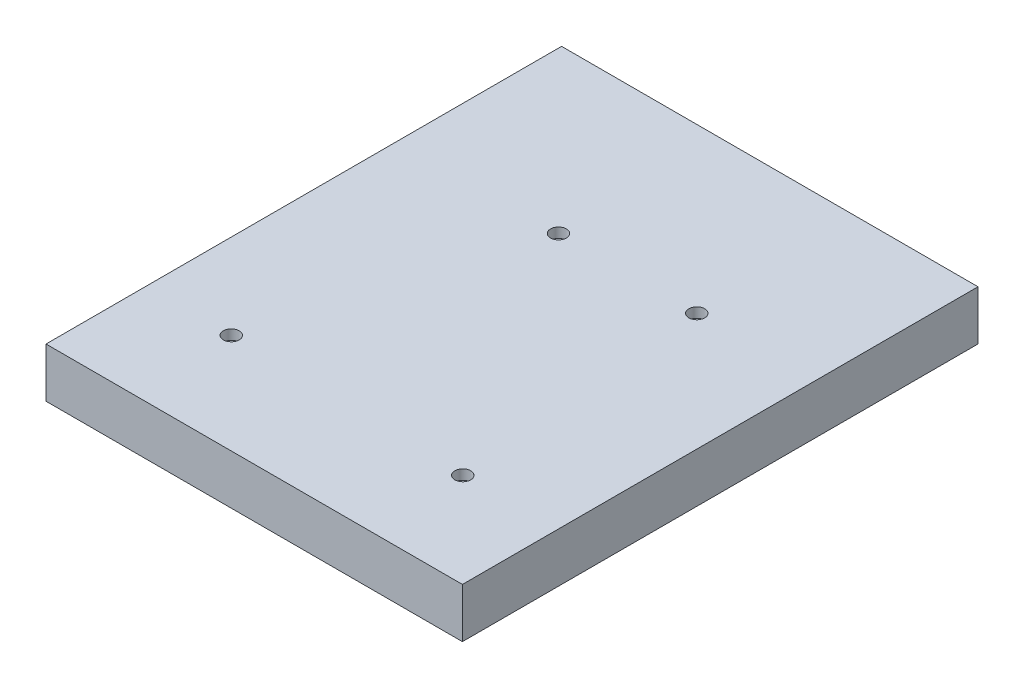
ISO-10303-21;
HEADER;
FILE_DESCRIPTION(('STEP AP214'),'2;1');
FILE_NAME('part.step','',(''),(''),'','','');
FILE_SCHEMA(('AUTOMOTIVE_DESIGN { 1 0 10303 214 1 1 1 1 }'));
ENDSEC;
DATA;
#1=APPLICATION_CONTEXT('core data for automotive mechanical design processes');
#2=APPLICATION_PROTOCOL_DEFINITION('international standard','automotive_design',2000,#1);
#3=PRODUCT_CONTEXT('',#1,'mechanical');
#4=PRODUCT('Part','Part','',(#3));
#5=PRODUCT_RELATED_PRODUCT_CATEGORY('part','',(#4));
#6=PRODUCT_DEFINITION_FORMATION('','',#4);
#7=PRODUCT_DEFINITION_CONTEXT('part definition',#1,'design');
#8=PRODUCT_DEFINITION('design','',#6,#7);
#9=PRODUCT_DEFINITION_SHAPE('','',#8);
#10=(LENGTH_UNIT() NAMED_UNIT(*) SI_UNIT(.MILLI.,.METRE.));
#11=(NAMED_UNIT(*) PLANE_ANGLE_UNIT() SI_UNIT($,.RADIAN.));
#12=(NAMED_UNIT(*) SI_UNIT($,.STERADIAN.) SOLID_ANGLE_UNIT());
#13=UNCERTAINTY_MEASURE_WITH_UNIT(LENGTH_MEASURE(1.E-05),#10,'distance_accuracy_value','');
#14=(GEOMETRIC_REPRESENTATION_CONTEXT(3) GLOBAL_UNCERTAINTY_ASSIGNED_CONTEXT((#13)) GLOBAL_UNIT_ASSIGNED_CONTEXT((#10,
#11,#12)) REPRESENTATION_CONTEXT('',''));
#15=CARTESIAN_POINT('',(0.,0.,0.));
#16=DIRECTION('',(0.,0.,1.));
#17=DIRECTION('',(1.,0.,0.));
#18=AXIS2_PLACEMENT_3D('',#15,#16,#17);
#19=CARTESIAN_POINT('',(-42.,20.,52.));
#20=DIRECTION('',(0.,0.,-1.));
#21=DIRECTION('',(-1.,0.,0.));
#22=AXIS2_PLACEMENT_3D('',#19,#20,#21);
#23=PLANE('',#22);
#24=DIRECTION('',(0.,-1.,0.));
#25=VECTOR('',#24,1.);
#26=CARTESIAN_POINT('',(42.,20.,52.));
#27=LINE('',#26,#25);
#28=CARTESIAN_POINT('',(42.,10.,52.));
#29=VERTEX_POINT('',#28);
#30=CARTESIAN_POINT('',(42.,0.,52.));
#31=VERTEX_POINT('',#30);
#32=EDGE_CURVE('E55',#29,#31,#27,.T.);
#33=ORIENTED_EDGE('',*,*,#32,.F.);
#34=DIRECTION('',(-1.,0.,0.));
#35=VECTOR('',#34,1.);
#36=CARTESIAN_POINT('',(-42.,10.,52.));
#37=LINE('',#36,#35);
#38=CARTESIAN_POINT('',(-42.,10.,52.));
#39=VERTEX_POINT('',#38);
#40=EDGE_CURVE('E98',#29,#39,#37,.T.);
#41=ORIENTED_EDGE('',*,*,#40,.T.);
#42=DIRECTION('',(0.,-1.,0.));
#43=VECTOR('',#42,1.);
#44=CARTESIAN_POINT('',(-42.,20.,52.));
#45=LINE('',#44,#43);
#46=CARTESIAN_POINT('',(-42.,0.,52.));
#47=VERTEX_POINT('',#46);
#48=EDGE_CURVE('E114',#39,#47,#45,.T.);
#49=ORIENTED_EDGE('',*,*,#48,.T.);
#50=DIRECTION('',(1.,0.,0.));
#51=VECTOR('',#50,1.);
#52=CARTESIAN_POINT('',(-42.,0.,52.));
#53=LINE('',#52,#51);
#54=EDGE_CURVE('E112',#47,#31,#53,.T.);
#55=ORIENTED_EDGE('',*,*,#54,.T.);
#56=EDGE_LOOP('',(#33,#41,#49,#55));
#57=FACE_BOUND('',#56,.T.);
#58=ADVANCED_FACE('F32',(#57),#23,.F.);
#59=CARTESIAN_POINT('',(-42.,20.,-52.));
#60=DIRECTION('',(0.,0.,1.));
#61=DIRECTION('',(1.,0.,0.));
#62=AXIS2_PLACEMENT_3D('',#59,#60,#61);
#63=PLANE('',#62);
#64=DIRECTION('',(0.,-1.,0.));
#65=VECTOR('',#64,1.);
#66=CARTESIAN_POINT('',(-42.,20.,-52.));
#67=LINE('',#66,#65);
#68=CARTESIAN_POINT('',(-42.,10.,-52.));
#69=VERTEX_POINT('',#68);
#70=CARTESIAN_POINT('',(-42.,0.,-52.));
#71=VERTEX_POINT('',#70);
#72=EDGE_CURVE('E40',#69,#71,#67,.T.);
#73=ORIENTED_EDGE('',*,*,#72,.F.);
#74=DIRECTION('',(1.,0.,0.));
#75=VECTOR('',#74,1.);
#76=CARTESIAN_POINT('',(0.,10.,-52.));
#77=LINE('',#76,#75);
#78=CARTESIAN_POINT('',(42.,10.,-52.));
#79=VERTEX_POINT('',#78);
#80=EDGE_CURVE('E106',#69,#79,#77,.T.);
#81=ORIENTED_EDGE('',*,*,#80,.T.);
#82=DIRECTION('',(0.,-1.,0.));
#83=VECTOR('',#82,1.);
#84=CARTESIAN_POINT('',(42.,20.,-52.));
#85=LINE('',#84,#83);
#86=CARTESIAN_POINT('',(42.,0.,-52.));
#87=VERTEX_POINT('',#86);
#88=EDGE_CURVE('E11',#79,#87,#85,.T.);
#89=ORIENTED_EDGE('',*,*,#88,.T.);
#90=DIRECTION('',(-1.,0.,0.));
#91=VECTOR('',#90,1.);
#92=CARTESIAN_POINT('',(-42.,0.,-52.));
#93=LINE('',#92,#91);
#94=EDGE_CURVE('E128',#87,#71,#93,.T.);
#95=ORIENTED_EDGE('',*,*,#94,.T.);
#96=EDGE_LOOP('',(#73,#81,#89,#95));
#97=FACE_BOUND('',#96,.T.);
#98=ADVANCED_FACE('F129',(#97),#63,.F.);
#99=CARTESIAN_POINT('',(42.,20.,-52.));
#100=DIRECTION('',(-1.,0.,0.));
#101=DIRECTION('',(0.,0.,1.));
#102=AXIS2_PLACEMENT_3D('',#99,#100,#101);
#103=PLANE('',#102);
#104=ORIENTED_EDGE('',*,*,#88,.F.);
#105=DIRECTION('',(0.,0.,1.));
#106=VECTOR('',#105,1.);
#107=CARTESIAN_POINT('',(42.,10.,-52.));
#108=LINE('',#107,#106);
#109=EDGE_CURVE('E100',#79,#29,#108,.T.);
#110=ORIENTED_EDGE('',*,*,#109,.T.);
#111=ORIENTED_EDGE('',*,*,#32,.T.);
#112=DIRECTION('',(0.,0.,-1.));
#113=VECTOR('',#112,1.);
#114=CARTESIAN_POINT('',(42.,0.,-52.));
#115=LINE('',#114,#113);
#116=EDGE_CURVE('E131',#31,#87,#115,.T.);
#117=ORIENTED_EDGE('',*,*,#116,.T.);
#118=EDGE_LOOP('',(#104,#110,#111,#117));
#119=FACE_BOUND('',#118,.T.);
#120=ADVANCED_FACE('F34',(#119),#103,.F.);
#121=CARTESIAN_POINT('',(-42.,20.,-52.));
#122=DIRECTION('',(1.,0.,0.));
#123=DIRECTION('',(0.,0.,-1.));
#124=AXIS2_PLACEMENT_3D('',#121,#122,#123);
#125=PLANE('',#124);
#126=ORIENTED_EDGE('',*,*,#48,.F.);
#127=DIRECTION('',(0.,0.,1.));
#128=VECTOR('',#127,1.);
#129=CARTESIAN_POINT('',(-42.,10.,-52.));
#130=LINE('',#129,#128);
#131=EDGE_CURVE('E103',#69,#39,#130,.T.);
#132=ORIENTED_EDGE('',*,*,#131,.F.);
#133=ORIENTED_EDGE('',*,*,#72,.T.);
#134=DIRECTION('',(0.,0.,1.));
#135=VECTOR('',#134,1.);
#136=CARTESIAN_POINT('',(-42.,0.,-52.));
#137=LINE('',#136,#135);
#138=EDGE_CURVE('E117',#71,#47,#137,.T.);
#139=ORIENTED_EDGE('',*,*,#138,.T.);
#140=EDGE_LOOP('',(#126,#132,#133,#139));
#141=FACE_BOUND('',#140,.T.);
#142=ADVANCED_FACE('F124',(#141),#125,.F.);
#143=CARTESIAN_POINT('',(0.,0.,0.));
#144=DIRECTION('',(0.,1.,0.));
#145=DIRECTION('',(0.,0.,1.));
#146=AXIS2_PLACEMENT_3D('',#143,#144,#145);
#147=PLANE('',#146);
#148=DIRECTION('',(1.,0.,0.));
#149=VECTOR('',#148,1.);
#150=CARTESIAN_POINT('',(41.,0.,-51.));
#151=LINE('',#150,#149);
#152=CARTESIAN_POINT('',(-41.,0.,-51.));
#153=VERTEX_POINT('',#152);
#154=CARTESIAN_POINT('',(41.,0.,-51.));
#155=VERTEX_POINT('',#154);
#156=EDGE_CURVE('E152',#153,#155,#151,.T.);
#157=ORIENTED_EDGE('',*,*,#156,.F.);
#158=DIRECTION('',(0.,0.,-1.));
#159=VECTOR('',#158,1.);
#160=CARTESIAN_POINT('',(-41.,0.,-51.));
#161=LINE('',#160,#159);
#162=CARTESIAN_POINT('',(-41.,0.,51.));
#163=VERTEX_POINT('',#162);
#164=EDGE_CURVE('E47',#163,#153,#161,.T.);
#165=ORIENTED_EDGE('',*,*,#164,.F.);
#166=DIRECTION('',(-1.,0.,0.));
#167=VECTOR('',#166,1.);
#168=CARTESIAN_POINT('',(41.,0.,51.));
#169=LINE('',#168,#167);
#170=CARTESIAN_POINT('',(41.,0.,51.));
#171=VERTEX_POINT('',#170);
#172=EDGE_CURVE('E145',#171,#163,#169,.T.);
#173=ORIENTED_EDGE('',*,*,#172,.F.);
#174=DIRECTION('',(0.,0.,1.));
#175=VECTOR('',#174,1.);
#176=CARTESIAN_POINT('',(41.,0.,-51.));
#177=LINE('',#176,#175);
#178=EDGE_CURVE('E149',#155,#171,#177,.T.);
#179=ORIENTED_EDGE('',*,*,#178,.F.);
#180=EDGE_LOOP('',(#157,#165,#173,#179));
#181=FACE_BOUND('',#180,.T.);
#182=ORIENTED_EDGE('',*,*,#116,.F.);
#183=ORIENTED_EDGE('',*,*,#54,.F.);
#184=ORIENTED_EDGE('',*,*,#138,.F.);
#185=ORIENTED_EDGE('',*,*,#94,.F.);
#186=EDGE_LOOP('',(#182,#183,#184,#185));
#187=FACE_BOUND('',#186,.T.);
#188=ADVANCED_FACE('F133',(#181,#187),#147,.F.);
#189=CARTESIAN_POINT('',(-41.,5.,-51.));
#190=DIRECTION('',(-1.,0.,0.));
#191=DIRECTION('',(0.,0.,1.));
#192=AXIS2_PLACEMENT_3D('',#189,#190,#191);
#193=PLANE('',#192);
#194=ORIENTED_EDGE('',*,*,#164,.T.);
#195=DIRECTION('',(0.,-1.,0.));
#196=VECTOR('',#195,1.);
#197=CARTESIAN_POINT('',(-41.,5.,-51.));
#198=LINE('',#197,#196);
#199=CARTESIAN_POINT('',(-41.,5.,-51.));
#200=VERTEX_POINT('',#199);
#201=EDGE_CURVE('E137',#200,#153,#198,.T.);
#202=ORIENTED_EDGE('',*,*,#201,.F.);
#203=DIRECTION('',(0.,0.,-1.));
#204=VECTOR('',#203,1.);
#205=CARTESIAN_POINT('',(-41.,5.,-51.));
#206=LINE('',#205,#204);
#207=CARTESIAN_POINT('',(-41.,5.,51.));
#208=VERTEX_POINT('',#207);
#209=EDGE_CURVE('E148',#208,#200,#206,.T.);
#210=ORIENTED_EDGE('',*,*,#209,.F.);
#211=DIRECTION('',(0.,-1.,0.));
#212=VECTOR('',#211,1.);
#213=CARTESIAN_POINT('',(-41.,5.,51.));
#214=LINE('',#213,#212);
#215=EDGE_CURVE('E136',#208,#163,#214,.T.);
#216=ORIENTED_EDGE('',*,*,#215,.T.);
#217=EDGE_LOOP('',(#194,#202,#210,#216));
#218=FACE_BOUND('',#217,.T.);
#219=ADVANCED_FACE('F230',(#218),#193,.F.);
#220=CARTESIAN_POINT('',(41.,5.,51.));
#221=DIRECTION('',(0.,0.,1.));
#222=DIRECTION('',(1.,0.,0.));
#223=AXIS2_PLACEMENT_3D('',#220,#221,#222);
#224=PLANE('',#223);
#225=ORIENTED_EDGE('',*,*,#172,.T.);
#226=ORIENTED_EDGE('',*,*,#215,.F.);
#227=DIRECTION('',(-1.,0.,0.));
#228=VECTOR('',#227,1.);
#229=CARTESIAN_POINT('',(41.,5.,51.));
#230=LINE('',#229,#228);
#231=CARTESIAN_POINT('',(41.,5.,51.));
#232=VERTEX_POINT('',#231);
#233=EDGE_CURVE('E140',#232,#208,#230,.T.);
#234=ORIENTED_EDGE('',*,*,#233,.F.);
#235=DIRECTION('',(0.,-1.,0.));
#236=VECTOR('',#235,1.);
#237=CARTESIAN_POINT('',(41.,5.,51.));
#238=LINE('',#237,#236);
#239=EDGE_CURVE('E142',#232,#171,#238,.T.);
#240=ORIENTED_EDGE('',*,*,#239,.T.);
#241=EDGE_LOOP('',(#225,#226,#234,#240));
#242=FACE_BOUND('',#241,.T.);
#243=ADVANCED_FACE('F340',(#242),#224,.F.);
#244=CARTESIAN_POINT('',(41.,5.,-51.));
#245=DIRECTION('',(1.,0.,0.));
#246=DIRECTION('',(0.,0.,-1.));
#247=AXIS2_PLACEMENT_3D('',#244,#245,#246);
#248=PLANE('',#247);
#249=ORIENTED_EDGE('',*,*,#178,.T.);
#250=ORIENTED_EDGE('',*,*,#239,.F.);
#251=DIRECTION('',(0.,0.,1.));
#252=VECTOR('',#251,1.);
#253=CARTESIAN_POINT('',(41.,5.,-51.));
#254=LINE('',#253,#252);
#255=CARTESIAN_POINT('',(41.,5.,-51.));
#256=VERTEX_POINT('',#255);
#257=EDGE_CURVE('E158',#256,#232,#254,.T.);
#258=ORIENTED_EDGE('',*,*,#257,.F.);
#259=DIRECTION('',(0.,-1.,0.));
#260=VECTOR('',#259,1.);
#261=CARTESIAN_POINT('',(41.,5.,-51.));
#262=LINE('',#261,#260);
#263=EDGE_CURVE('E139',#256,#155,#262,.T.);
#264=ORIENTED_EDGE('',*,*,#263,.T.);
#265=EDGE_LOOP('',(#249,#250,#258,#264));
#266=FACE_BOUND('',#265,.T.);
#267=ADVANCED_FACE('F330',(#266),#248,.F.);
#268=CARTESIAN_POINT('',(41.,5.,-51.));
#269=DIRECTION('',(0.,0.,-1.));
#270=DIRECTION('',(-1.,0.,0.));
#271=AXIS2_PLACEMENT_3D('',#268,#269,#270);
#272=PLANE('',#271);
#273=ORIENTED_EDGE('',*,*,#156,.T.);
#274=ORIENTED_EDGE('',*,*,#263,.F.);
#275=DIRECTION('',(1.,0.,0.));
#276=VECTOR('',#275,1.);
#277=CARTESIAN_POINT('',(41.,5.,-51.));
#278=LINE('',#277,#276);
#279=EDGE_CURVE('E161',#200,#256,#278,.T.);
#280=ORIENTED_EDGE('',*,*,#279,.F.);
#281=ORIENTED_EDGE('',*,*,#201,.T.);
#282=EDGE_LOOP('',(#273,#274,#280,#281));
#283=FACE_BOUND('',#282,.T.);
#284=ADVANCED_FACE('F320',(#283),#272,.F.);
#285=CARTESIAN_POINT('',(0.,5.,0.));
#286=DIRECTION('',(0.,-1.,0.));
#287=DIRECTION('',(0.,0.,-1.));
#288=AXIS2_PLACEMENT_3D('',#285,#286,#287);
#289=PLANE('',#288);
#290=ORIENTED_EDGE('',*,*,#209,.T.);
#291=ORIENTED_EDGE('',*,*,#279,.T.);
#292=ORIENTED_EDGE('',*,*,#257,.T.);
#293=ORIENTED_EDGE('',*,*,#233,.T.);
#294=EDGE_LOOP('',(#290,#291,#292,#293));
#295=FACE_BOUND('',#294,.T.);
#296=ADVANCED_FACE('F203',(#295),#289,.T.);
#297=CARTESIAN_POINT('',(0.,10.,0.));
#298=DIRECTION('',(0.,1.,0.));
#299=DIRECTION('',(0.,0.,1.));
#300=AXIS2_PLACEMENT_3D('',#297,#298,#299);
#301=PLANE('',#300);
#302=CARTESIAN_POINT('',(-9.62499999999999,10.,-19.));
#303=DIRECTION('',(0.,1.,0.));
#304=DIRECTION('',(0.,0.,1.));
#305=AXIS2_PLACEMENT_3D('',#302,#303,#304);
#306=CIRCLE('',#305,1.6);
#307=CARTESIAN_POINT('',(-9.62499999999999,10.,-17.4));
#308=VERTEX_POINT('',#307);
#309=EDGE_CURVE('E109',#308,#308,#306,.T.);
#310=ORIENTED_EDGE('',*,*,#309,.F.);
#311=EDGE_LOOP('',(#310));
#312=FACE_BOUND('',#311,.T.);
#313=CARTESIAN_POINT('',(22.975,10.,32.9));
#314=DIRECTION('',(0.,1.,0.));
#315=DIRECTION('',(0.,0.,1.));
#316=AXIS2_PLACEMENT_3D('',#313,#314,#315);
#317=CIRCLE('',#316,1.6);
#318=CARTESIAN_POINT('',(22.975,10.,34.5));
#319=VERTEX_POINT('',#318);
#320=EDGE_CURVE('E178',#319,#319,#317,.T.);
#321=ORIENTED_EDGE('',*,*,#320,.F.);
#322=EDGE_LOOP('',(#321));
#323=FACE_BOUND('',#322,.T.);
#324=CARTESIAN_POINT('',(-24.825,10.,31.8));
#325=DIRECTION('',(0.,1.,0.));
#326=DIRECTION('',(0.,0.,1.));
#327=AXIS2_PLACEMENT_3D('',#324,#325,#326);
#328=CIRCLE('',#327,1.6);
#329=CARTESIAN_POINT('',(-24.825,10.,33.4));
#330=VERTEX_POINT('',#329);
#331=EDGE_CURVE('E184',#330,#330,#328,.T.);
#332=ORIENTED_EDGE('',*,*,#331,.F.);
#333=EDGE_LOOP('',(#332));
#334=FACE_BOUND('',#333,.T.);
#335=CARTESIAN_POINT('',(18.275,10.,-19.));
#336=DIRECTION('',(0.,1.,0.));
#337=DIRECTION('',(0.,0.,1.));
#338=AXIS2_PLACEMENT_3D('',#335,#336,#337);
#339=CIRCLE('',#338,1.6);
#340=CARTESIAN_POINT('',(18.275,10.,-17.4));
#341=VERTEX_POINT('',#340);
#342=EDGE_CURVE('E167',#341,#341,#339,.T.);
#343=ORIENTED_EDGE('',*,*,#342,.F.);
#344=EDGE_LOOP('',(#343));
#345=FACE_BOUND('',#344,.T.);
#346=ORIENTED_EDGE('',*,*,#109,.F.);
#347=ORIENTED_EDGE('',*,*,#80,.F.);
#348=ORIENTED_EDGE('',*,*,#131,.T.);
#349=ORIENTED_EDGE('',*,*,#40,.F.);
#350=EDGE_LOOP('',(#346,#347,#348,#349));
#351=FACE_BOUND('',#350,.T.);
#352=ADVANCED_FACE('F99',(#312,#323,#334,#345,#351),#301,.T.);
#353=CARTESIAN_POINT('',(18.275,8.,-19.));
#354=DIRECTION('',(0.,1.,0.));
#355=DIRECTION('',(0.,0.,1.));
#356=AXIS2_PLACEMENT_3D('',#353,#354,#355);
#357=CYLINDRICAL_SURFACE('',#356,1.6);
#358=CARTESIAN_POINT('',(18.275,8.,-19.));
#359=DIRECTION('',(0.,1.,0.));
#360=DIRECTION('',(0.,0.,1.));
#361=AXIS2_PLACEMENT_3D('',#358,#359,#360);
#362=CIRCLE('',#361,1.6);
#363=CARTESIAN_POINT('',(18.275,8.,-17.4));
#364=VERTEX_POINT('',#363);
#365=EDGE_CURVE('E107',#364,#364,#362,.T.);
#366=ORIENTED_EDGE('',*,*,#365,.F.);
#367=EDGE_LOOP('',(#366));
#368=FACE_BOUND('',#367,.T.);
#369=ORIENTED_EDGE('',*,*,#342,.T.);
#370=EDGE_LOOP('',(#369));
#371=FACE_BOUND('',#370,.T.);
#372=ADVANCED_FACE('F202',(#368,#371),#357,.F.);
#373=CARTESIAN_POINT('',(0.,8.,0.));
#374=DIRECTION('',(0.,1.,0.));
#375=DIRECTION('',(0.,0.,1.));
#376=AXIS2_PLACEMENT_3D('',#373,#374,#375);
#377=PLANE('',#376);
#378=ORIENTED_EDGE('',*,*,#365,.T.);
#379=EDGE_LOOP('',(#378));
#380=FACE_BOUND('',#379,.T.);
#381=ADVANCED_FACE('F196',(#380),#377,.T.);
#382=CARTESIAN_POINT('',(-24.825,8.,31.8));
#383=DIRECTION('',(0.,1.,0.));
#384=DIRECTION('',(0.,0.,1.));
#385=AXIS2_PLACEMENT_3D('',#382,#383,#384);
#386=CYLINDRICAL_SURFACE('',#385,1.6);
#387=CARTESIAN_POINT('',(-24.825,8.,31.8));
#388=DIRECTION('',(0.,1.,0.));
#389=DIRECTION('',(0.,0.,1.));
#390=AXIS2_PLACEMENT_3D('',#387,#388,#389);
#391=CIRCLE('',#390,1.6);
#392=CARTESIAN_POINT('',(-24.825,8.,33.4));
#393=VERTEX_POINT('',#392);
#394=EDGE_CURVE('E170',#393,#393,#391,.T.);
#395=ORIENTED_EDGE('',*,*,#394,.F.);
#396=EDGE_LOOP('',(#395));
#397=FACE_BOUND('',#396,.T.);
#398=ORIENTED_EDGE('',*,*,#331,.T.);
#399=EDGE_LOOP('',(#398));
#400=FACE_BOUND('',#399,.T.);
#401=ADVANCED_FACE('F193',(#397,#400),#386,.F.);
#402=CARTESIAN_POINT('',(0.,8.,0.));
#403=DIRECTION('',(0.,1.,0.));
#404=DIRECTION('',(0.,0.,1.));
#405=AXIS2_PLACEMENT_3D('',#402,#403,#404);
#406=PLANE('',#405);
#407=ORIENTED_EDGE('',*,*,#394,.T.);
#408=EDGE_LOOP('',(#407));
#409=FACE_BOUND('',#408,.T.);
#410=ADVANCED_FACE('F191',(#409),#406,.T.);
#411=CARTESIAN_POINT('',(22.975,8.,32.9));
#412=DIRECTION('',(0.,1.,0.));
#413=DIRECTION('',(0.,0.,1.));
#414=AXIS2_PLACEMENT_3D('',#411,#412,#413);
#415=CYLINDRICAL_SURFACE('',#414,1.6);
#416=CARTESIAN_POINT('',(22.975,8.,32.9));
#417=DIRECTION('',(0.,1.,0.));
#418=DIRECTION('',(0.,0.,1.));
#419=AXIS2_PLACEMENT_3D('',#416,#417,#418);
#420=CIRCLE('',#419,1.6);
#421=CARTESIAN_POINT('',(22.975,8.,34.5));
#422=VERTEX_POINT('',#421);
#423=EDGE_CURVE('E181',#422,#422,#420,.T.);
#424=ORIENTED_EDGE('',*,*,#423,.F.);
#425=EDGE_LOOP('',(#424));
#426=FACE_BOUND('',#425,.T.);
#427=ORIENTED_EDGE('',*,*,#320,.T.);
#428=EDGE_LOOP('',(#427));
#429=FACE_BOUND('',#428,.T.);
#430=ADVANCED_FACE('F276',(#426,#429),#415,.F.);
#431=CARTESIAN_POINT('',(0.,8.,0.));
#432=DIRECTION('',(0.,1.,0.));
#433=DIRECTION('',(0.,0.,1.));
#434=AXIS2_PLACEMENT_3D('',#431,#432,#433);
#435=PLANE('',#434);
#436=ORIENTED_EDGE('',*,*,#423,.T.);
#437=EDGE_LOOP('',(#436));
#438=FACE_BOUND('',#437,.T.);
#439=ADVANCED_FACE('F266',(#438),#435,.T.);
#440=CARTESIAN_POINT('',(-9.62499999999999,8.,-19.));
#441=DIRECTION('',(0.,1.,0.));
#442=DIRECTION('',(0.,0.,1.));
#443=AXIS2_PLACEMENT_3D('',#440,#441,#442);
#444=CYLINDRICAL_SURFACE('',#443,1.6);
#445=CARTESIAN_POINT('',(-9.62499999999999,8.,-19.));
#446=DIRECTION('',(0.,1.,0.));
#447=DIRECTION('',(0.,0.,1.));
#448=AXIS2_PLACEMENT_3D('',#445,#446,#447);
#449=CIRCLE('',#448,1.6);
#450=CARTESIAN_POINT('',(-9.62499999999999,8.,-17.4));
#451=VERTEX_POINT('',#450);
#452=EDGE_CURVE('E175',#451,#451,#449,.T.);
#453=ORIENTED_EDGE('',*,*,#452,.F.);
#454=EDGE_LOOP('',(#453));
#455=FACE_BOUND('',#454,.T.);
#456=ORIENTED_EDGE('',*,*,#309,.T.);
#457=EDGE_LOOP('',(#456));
#458=FACE_BOUND('',#457,.T.);
#459=ADVANCED_FACE('F255',(#455,#458),#444,.F.);
#460=CARTESIAN_POINT('',(0.,8.,0.));
#461=DIRECTION('',(0.,1.,0.));
#462=DIRECTION('',(0.,0.,1.));
#463=AXIS2_PLACEMENT_3D('',#460,#461,#462);
#464=PLANE('',#463);
#465=ORIENTED_EDGE('',*,*,#452,.T.);
#466=EDGE_LOOP('',(#465));
#467=FACE_BOUND('',#466,.T.);
#468=ADVANCED_FACE('F250',(#467),#464,.T.);
#469=CLOSED_SHELL('',(#58,#98,#120,#142,#188,#219,#243,#267,#284,#296,#352,#372,#381,#401,#410,
#430,#439,#459,#468));
#470=MANIFOLD_SOLID_BREP('B2',#469);
#471=ADVANCED_BREP_SHAPE_REPRESENTATION('',(#18,#470),#14);
#472=SHAPE_DEFINITION_REPRESENTATION(#9,#471);
ENDSEC;
END-ISO-10303-21;
